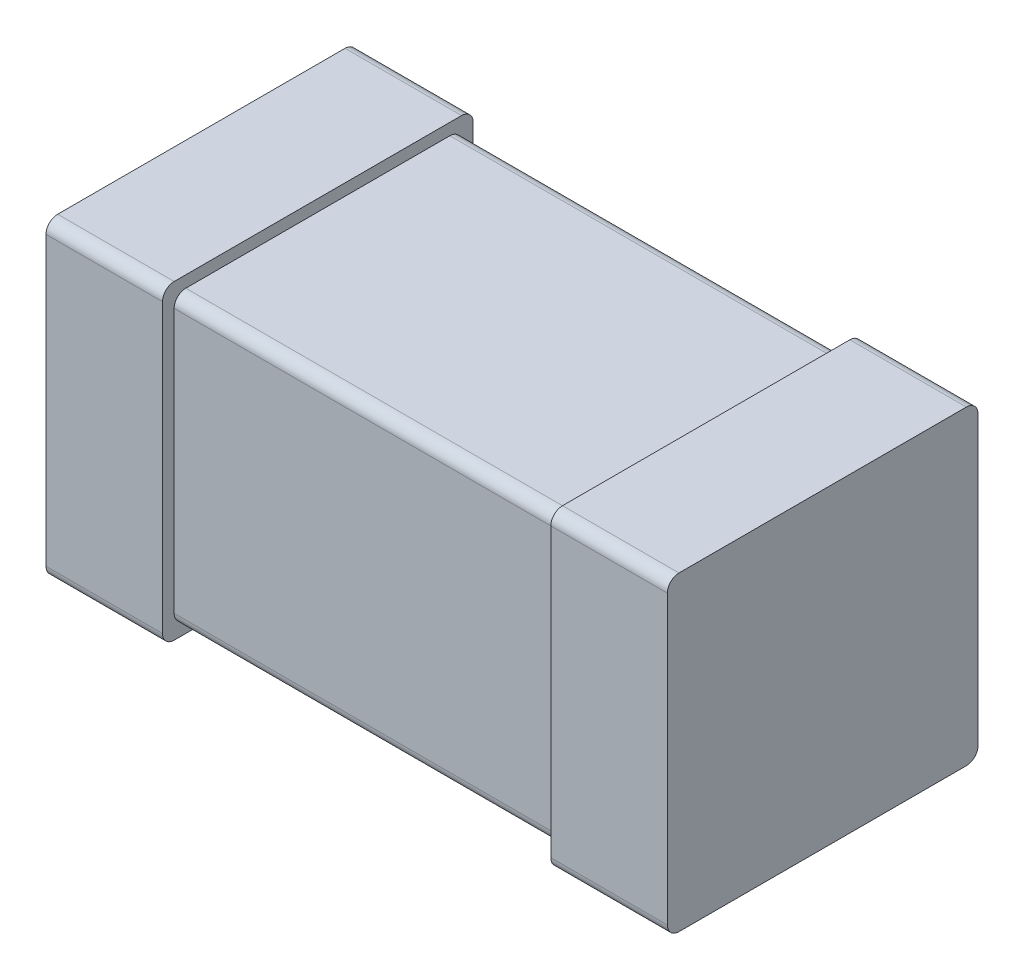
ISO-10303-21;
HEADER;
FILE_DESCRIPTION(('STEP AP214'),'2;1');
FILE_NAME('part.step','',(''),(''),'','','');
FILE_SCHEMA(('AUTOMOTIVE_DESIGN { 1 0 10303 214 1 1 1 1 }'));
ENDSEC;
DATA;
#1=APPLICATION_CONTEXT('core data for automotive mechanical design processes');
#2=APPLICATION_PROTOCOL_DEFINITION('international standard','automotive_design',2000,#1);
#3=PRODUCT_CONTEXT('',#1,'mechanical');
#4=PRODUCT('Part','Part','',(#3));
#5=PRODUCT_RELATED_PRODUCT_CATEGORY('part','',(#4));
#6=PRODUCT_DEFINITION_FORMATION('','',#4);
#7=PRODUCT_DEFINITION_CONTEXT('part definition',#1,'design');
#8=PRODUCT_DEFINITION('design','',#6,#7);
#9=PRODUCT_DEFINITION_SHAPE('','',#8);
#10=(LENGTH_UNIT() NAMED_UNIT(*) SI_UNIT(.MILLI.,.METRE.));
#11=(NAMED_UNIT(*) PLANE_ANGLE_UNIT() SI_UNIT($,.RADIAN.));
#12=(NAMED_UNIT(*) SI_UNIT($,.STERADIAN.) SOLID_ANGLE_UNIT());
#13=UNCERTAINTY_MEASURE_WITH_UNIT(LENGTH_MEASURE(1.E-05),#10,'distance_accuracy_value','');
#14=(GEOMETRIC_REPRESENTATION_CONTEXT(3) GLOBAL_UNCERTAINTY_ASSIGNED_CONTEXT((#13)) GLOBAL_UNIT_ASSIGNED_CONTEXT((#10,
#11,#12)) REPRESENTATION_CONTEXT('',''));
#15=CARTESIAN_POINT('',(0.,0.,0.));
#16=DIRECTION('',(0.,0.,1.));
#17=DIRECTION('',(1.,0.,0.));
#18=AXIS2_PLACEMENT_3D('',#15,#16,#17);
#19=CARTESIAN_POINT('',(-0.8,-0.4,0.));
#20=DIRECTION('',(1.,0.,0.));
#21=DIRECTION('',(0.,0.,-1.));
#22=AXIS2_PLACEMENT_3D('',#19,#20,#21);
#23=PLANE('',#22);
#24=CARTESIAN_POINT('',(-0.8,0.370000000000001,0.770000000000001));
#25=DIRECTION('',(1.,0.,0.));
#26=DIRECTION('',(0.,0.,-1.));
#27=AXIS2_PLACEMENT_3D('',#24,#25,#26);
#28=CIRCLE('',#27,0.0299999999999999);
#29=CARTESIAN_POINT('',(-0.8,0.4,0.770000000000001));
#30=VERTEX_POINT('',#29);
#31=CARTESIAN_POINT('',(-0.8,0.370000000000001,0.800000000000001));
#32=VERTEX_POINT('',#31);
#33=EDGE_CURVE('E298',#30,#32,#28,.T.);
#34=ORIENTED_EDGE('',*,*,#33,.F.);
#35=DIRECTION('',(0.,0.,1.));
#36=VECTOR('',#35,1.);
#37=CARTESIAN_POINT('',(-0.8,0.4,0.));
#38=LINE('',#37,#36);
#39=CARTESIAN_POINT('',(-0.8,0.4,0.0299999999999999));
#40=VERTEX_POINT('',#39);
#41=EDGE_CURVE('E225',#40,#30,#38,.T.);
#42=ORIENTED_EDGE('',*,*,#41,.F.);
#43=CARTESIAN_POINT('',(-0.8,0.370000000000001,0.0299999999999999));
#44=DIRECTION('',(1.,0.,0.));
#45=DIRECTION('',(0.,0.,-1.));
#46=AXIS2_PLACEMENT_3D('',#43,#44,#45);
#47=CIRCLE('',#46,0.0299999999999999);
#48=CARTESIAN_POINT('',(-0.8,0.370000000000001,0.));
#49=VERTEX_POINT('',#48);
#50=EDGE_CURVE('E228',#49,#40,#47,.T.);
#51=ORIENTED_EDGE('',*,*,#50,.F.);
#52=DIRECTION('',(0.,1.,0.));
#53=VECTOR('',#52,1.);
#54=CARTESIAN_POINT('',(-0.8,-0.4,0.));
#55=LINE('',#54,#53);
#56=CARTESIAN_POINT('',(-0.8,-0.370000000000001,0.));
#57=VERTEX_POINT('',#56);
#58=EDGE_CURVE('E229',#49,#57,#55,.F.);
#59=ORIENTED_EDGE('',*,*,#58,.T.);
#60=CARTESIAN_POINT('',(-0.8,-0.370000000000001,0.0299999999999999));
#61=DIRECTION('',(1.,0.,0.));
#62=DIRECTION('',(0.,0.,-1.));
#63=AXIS2_PLACEMENT_3D('',#60,#61,#62);
#64=CIRCLE('',#63,0.0299999999999999);
#65=CARTESIAN_POINT('',(-0.8,-0.4,0.0299999999999999));
#66=VERTEX_POINT('',#65);
#67=EDGE_CURVE('E192',#66,#57,#64,.T.);
#68=ORIENTED_EDGE('',*,*,#67,.F.);
#69=DIRECTION('',(0.,0.,1.));
#70=VECTOR('',#69,1.);
#71=CARTESIAN_POINT('',(-0.8,-0.4,0.));
#72=LINE('',#71,#70);
#73=CARTESIAN_POINT('',(-0.8,-0.4,0.770000000000001));
#74=VERTEX_POINT('',#73);
#75=EDGE_CURVE('E189',#66,#74,#72,.T.);
#76=ORIENTED_EDGE('',*,*,#75,.T.);
#77=CARTESIAN_POINT('',(-0.8,-0.370000000000001,0.770000000000001));
#78=DIRECTION('',(1.,0.,0.));
#79=DIRECTION('',(0.,0.,-1.));
#80=AXIS2_PLACEMENT_3D('',#77,#78,#79);
#81=CIRCLE('',#80,0.0299999999999999);
#82=CARTESIAN_POINT('',(-0.8,-0.370000000000001,0.800000000000001));
#83=VERTEX_POINT('',#82);
#84=EDGE_CURVE('E20',#83,#74,#81,.T.);
#85=ORIENTED_EDGE('',*,*,#84,.F.);
#86=DIRECTION('',(0.,1.,0.));
#87=VECTOR('',#86,1.);
#88=CARTESIAN_POINT('',(-0.8,-0.4,0.8));
#89=LINE('',#88,#87);
#90=EDGE_CURVE('E175',#32,#83,#89,.F.);
#91=ORIENTED_EDGE('',*,*,#90,.F.);
#92=EDGE_LOOP('',(#34,#42,#51,#59,#68,#76,#85,#91));
#93=FACE_BOUND('',#92,.T.);
#94=ADVANCED_FACE('F17',(#93),#23,.F.);
#95=CARTESIAN_POINT('',(0.8,-0.4,0.));
#96=DIRECTION('',(1.,0.,0.));
#97=DIRECTION('',(0.,0.,-1.));
#98=AXIS2_PLACEMENT_3D('',#95,#96,#97);
#99=PLANE('',#98);
#100=DIRECTION('',(0.,0.,1.));
#101=VECTOR('',#100,1.);
#102=CARTESIAN_POINT('',(0.8,0.4,0.));
#103=LINE('',#102,#101);
#104=CARTESIAN_POINT('',(0.8,0.4,0.770000000000001));
#105=VERTEX_POINT('',#104);
#106=CARTESIAN_POINT('',(0.8,0.4,0.0299999999999999));
#107=VERTEX_POINT('',#106);
#108=EDGE_CURVE('E211',#105,#107,#103,.F.);
#109=ORIENTED_EDGE('',*,*,#108,.F.);
#110=CARTESIAN_POINT('',(0.8,0.370000000000001,0.770000000000001));
#111=DIRECTION('',(1.,0.,0.));
#112=DIRECTION('',(0.,0.,-1.));
#113=AXIS2_PLACEMENT_3D('',#110,#111,#112);
#114=CIRCLE('',#113,0.0299999999999999);
#115=CARTESIAN_POINT('',(0.8,0.370000000000001,0.8));
#116=VERTEX_POINT('',#115);
#117=EDGE_CURVE('E286',#116,#105,#114,.F.);
#118=ORIENTED_EDGE('',*,*,#117,.F.);
#119=DIRECTION('',(0.,1.,0.));
#120=VECTOR('',#119,1.);
#121=CARTESIAN_POINT('',(0.8,-0.4,0.8));
#122=LINE('',#121,#120);
#123=CARTESIAN_POINT('',(0.8,-0.370000000000001,0.8));
#124=VERTEX_POINT('',#123);
#125=EDGE_CURVE('E206',#124,#116,#122,.T.);
#126=ORIENTED_EDGE('',*,*,#125,.F.);
#127=CARTESIAN_POINT('',(0.8,-0.370000000000001,0.770000000000001));
#128=DIRECTION('',(1.,0.,0.));
#129=DIRECTION('',(0.,0.,-1.));
#130=AXIS2_PLACEMENT_3D('',#127,#128,#129);
#131=CIRCLE('',#130,0.0299999999999999);
#132=CARTESIAN_POINT('',(0.8,-0.4,0.770000000000001));
#133=VERTEX_POINT('',#132);
#134=EDGE_CURVE('E294',#133,#124,#131,.F.);
#135=ORIENTED_EDGE('',*,*,#134,.F.);
#136=DIRECTION('',(0.,0.,1.));
#137=VECTOR('',#136,1.);
#138=CARTESIAN_POINT('',(0.8,-0.4,0.));
#139=LINE('',#138,#137);
#140=CARTESIAN_POINT('',(0.8,-0.4,0.0299999999999999));
#141=VERTEX_POINT('',#140);
#142=EDGE_CURVE('E220',#133,#141,#139,.F.);
#143=ORIENTED_EDGE('',*,*,#142,.T.);
#144=CARTESIAN_POINT('',(0.8,-0.370000000000001,0.0299999999999999));
#145=DIRECTION('',(1.,0.,0.));
#146=DIRECTION('',(0.,0.,-1.));
#147=AXIS2_PLACEMENT_3D('',#144,#145,#146);
#148=CIRCLE('',#147,0.0299999999999999);
#149=CARTESIAN_POINT('',(0.8,-0.370000000000001,0.));
#150=VERTEX_POINT('',#149);
#151=EDGE_CURVE('E222',#150,#141,#148,.F.);
#152=ORIENTED_EDGE('',*,*,#151,.F.);
#153=DIRECTION('',(0.,1.,0.));
#154=VECTOR('',#153,1.);
#155=CARTESIAN_POINT('',(0.8,-0.4,0.));
#156=LINE('',#155,#154);
#157=CARTESIAN_POINT('',(0.8,0.370000000000001,0.));
#158=VERTEX_POINT('',#157);
#159=EDGE_CURVE('E216',#150,#158,#156,.T.);
#160=ORIENTED_EDGE('',*,*,#159,.T.);
#161=CARTESIAN_POINT('',(0.8,0.370000000000001,0.0299999999999999));
#162=DIRECTION('',(1.,0.,0.));
#163=DIRECTION('',(0.,0.,-1.));
#164=AXIS2_PLACEMENT_3D('',#161,#162,#163);
#165=CIRCLE('',#164,0.0299999999999999);
#166=EDGE_CURVE('E215',#107,#158,#165,.F.);
#167=ORIENTED_EDGE('',*,*,#166,.F.);
#168=EDGE_LOOP('',(#109,#118,#126,#135,#143,#152,#160,#167));
#169=FACE_BOUND('',#168,.T.);
#170=ADVANCED_FACE('F650',(#169),#99,.T.);
#171=CARTESIAN_POINT('',(-0.8,-0.4,0.8));
#172=DIRECTION('',(0.,0.,1.));
#173=DIRECTION('',(1.,0.,0.));
#174=AXIS2_PLACEMENT_3D('',#171,#172,#173);
#175=PLANE('',#174);
#176=ORIENTED_EDGE('',*,*,#90,.T.);
#177=DIRECTION('',(1.,0.,0.));
#178=VECTOR('',#177,1.);
#179=CARTESIAN_POINT('',(-0.8,-0.370000000000001,0.800000000000001));
#180=LINE('',#179,#178);
#181=CARTESIAN_POINT('',(-0.499999999999999,-0.370000000000001,0.800000000000001));
#182=VERTEX_POINT('',#181);
#183=EDGE_CURVE('E186',#182,#83,#180,.F.);
#184=ORIENTED_EDGE('',*,*,#183,.F.);
#185=DIRECTION('',(0.,1.,0.));
#186=VECTOR('',#185,1.);
#187=CARTESIAN_POINT('',(-0.499999999999999,-0.4,0.8));
#188=LINE('',#187,#186);
#189=CARTESIAN_POINT('',(-0.499999999999999,0.370000000000001,0.800000000000001));
#190=VERTEX_POINT('',#189);
#191=EDGE_CURVE('E285',#190,#182,#188,.F.);
#192=ORIENTED_EDGE('',*,*,#191,.F.);
#193=DIRECTION('',(1.,0.,0.));
#194=VECTOR('',#193,1.);
#195=CARTESIAN_POINT('',(-0.8,0.370000000000001,0.800000000000001));
#196=LINE('',#195,#194);
#197=EDGE_CURVE('E297',#32,#190,#196,.T.);
#198=ORIENTED_EDGE('',*,*,#197,.F.);
#199=EDGE_LOOP('',(#176,#184,#192,#198));
#200=FACE_BOUND('',#199,.T.);
#201=ADVANCED_FACE('F642',(#200),#175,.T.);
#202=CARTESIAN_POINT('',(-0.8,-0.370000000000001,0.770000000000001));
#203=DIRECTION('',(1.,0.,0.));
#204=DIRECTION('',(0.,0.,-1.));
#205=AXIS2_PLACEMENT_3D('',#202,#203,#204);
#206=CYLINDRICAL_SURFACE('',#205,0.0299999999999999);
#207=DIRECTION('',(1.,0.,0.));
#208=VECTOR('',#207,1.);
#209=CARTESIAN_POINT('',(-0.8,-0.4,0.770000000000001));
#210=LINE('',#209,#208);
#211=CARTESIAN_POINT('',(-0.499999999999999,-0.4,0.770000000000001));
#212=VERTEX_POINT('',#211);
#213=EDGE_CURVE('E184',#74,#212,#210,.T.);
#214=ORIENTED_EDGE('',*,*,#213,.T.);
#215=CARTESIAN_POINT('',(-0.499999999999999,-0.370000000000001,0.770000000000001));
#216=DIRECTION('',(1.,0.,0.));
#217=DIRECTION('',(0.,0.,-1.));
#218=AXIS2_PLACEMENT_3D('',#215,#216,#217);
#219=CIRCLE('',#218,0.0299999999999999);
#220=EDGE_CURVE('E283',#182,#212,#219,.T.);
#221=ORIENTED_EDGE('',*,*,#220,.F.);
#222=ORIENTED_EDGE('',*,*,#183,.T.);
#223=ORIENTED_EDGE('',*,*,#84,.T.);
#224=EDGE_LOOP('',(#214,#221,#222,#223));
#225=FACE_BOUND('',#224,.T.);
#226=ADVANCED_FACE('F181',(#225),#206,.T.);
#227=CARTESIAN_POINT('',(-0.8,-0.4,0.));
#228=DIRECTION('',(0.,1.,0.));
#229=DIRECTION('',(0.,0.,1.));
#230=AXIS2_PLACEMENT_3D('',#227,#228,#229);
#231=PLANE('',#230);
#232=DIRECTION('',(1.,0.,0.));
#233=VECTOR('',#232,1.);
#234=CARTESIAN_POINT('',(-0.8,-0.400000000000001,0.0299999999999999));
#235=LINE('',#234,#233);
#236=CARTESIAN_POINT('',(-0.499999999999999,-0.4,0.0299999999999999));
#237=VERTEX_POINT('',#236);
#238=EDGE_CURVE('E195',#237,#66,#235,.F.);
#239=ORIENTED_EDGE('',*,*,#238,.F.);
#240=DIRECTION('',(0.,0.,-1.));
#241=VECTOR('',#240,1.);
#242=CARTESIAN_POINT('',(-0.499999999999999,-0.4,0.));
#243=LINE('',#242,#241);
#244=EDGE_CURVE('E199',#212,#237,#243,.T.);
#245=ORIENTED_EDGE('',*,*,#244,.F.);
#246=ORIENTED_EDGE('',*,*,#213,.F.);
#247=ORIENTED_EDGE('',*,*,#75,.F.);
#248=EDGE_LOOP('',(#239,#245,#246,#247));
#249=FACE_BOUND('',#248,.T.);
#250=ADVANCED_FACE('F197',(#249),#231,.F.);
#251=CARTESIAN_POINT('',(-0.8,-0.370000000000001,0.0299999999999999));
#252=DIRECTION('',(1.,0.,0.));
#253=DIRECTION('',(0.,0.,-1.));
#254=AXIS2_PLACEMENT_3D('',#251,#252,#253);
#255=CYLINDRICAL_SURFACE('',#254,0.0299999999999999);
#256=ORIENTED_EDGE('',*,*,#67,.T.);
#257=DIRECTION('',(1.,0.,0.));
#258=VECTOR('',#257,1.);
#259=CARTESIAN_POINT('',(-0.8,-0.370000000000001,0.));
#260=LINE('',#259,#258);
#261=CARTESIAN_POINT('',(-0.499999999999999,-0.370000000000001,0.));
#262=VERTEX_POINT('',#261);
#263=EDGE_CURVE('E230',#57,#262,#260,.T.);
#264=ORIENTED_EDGE('',*,*,#263,.T.);
#265=CARTESIAN_POINT('',(-0.499999999999999,-0.370000000000001,0.0299999999999999));
#266=DIRECTION('',(1.,0.,0.));
#267=DIRECTION('',(0.,0.,-1.));
#268=AXIS2_PLACEMENT_3D('',#265,#266,#267);
#269=CIRCLE('',#268,0.0299999999999999);
#270=EDGE_CURVE('E280',#237,#262,#269,.T.);
#271=ORIENTED_EDGE('',*,*,#270,.F.);
#272=ORIENTED_EDGE('',*,*,#238,.T.);
#273=EDGE_LOOP('',(#256,#264,#271,#272));
#274=FACE_BOUND('',#273,.T.);
#275=ADVANCED_FACE('F307',(#274),#255,.T.);
#276=CARTESIAN_POINT('',(-0.8,-0.4,0.));
#277=DIRECTION('',(0.,0.,1.));
#278=DIRECTION('',(1.,0.,0.));
#279=AXIS2_PLACEMENT_3D('',#276,#277,#278);
#280=PLANE('',#279);
#281=ORIENTED_EDGE('',*,*,#263,.F.);
#282=ORIENTED_EDGE('',*,*,#58,.F.);
#283=DIRECTION('',(1.,0.,0.));
#284=VECTOR('',#283,1.);
#285=CARTESIAN_POINT('',(-0.8,0.370000000000001,0.));
#286=LINE('',#285,#284);
#287=CARTESIAN_POINT('',(-0.499999999999999,0.370000000000001,0.));
#288=VERTEX_POINT('',#287);
#289=EDGE_CURVE('E303',#288,#49,#286,.F.);
#290=ORIENTED_EDGE('',*,*,#289,.F.);
#291=DIRECTION('',(0.,1.,0.));
#292=VECTOR('',#291,1.);
#293=CARTESIAN_POINT('',(-0.499999999999999,-0.4,0.));
#294=LINE('',#293,#292);
#295=EDGE_CURVE('E279',#262,#288,#294,.T.);
#296=ORIENTED_EDGE('',*,*,#295,.F.);
#297=EDGE_LOOP('',(#281,#282,#290,#296));
#298=FACE_BOUND('',#297,.T.);
#299=ADVANCED_FACE('F362',(#298),#280,.F.);
#300=CARTESIAN_POINT('',(-0.8,0.370000000000001,0.0299999999999999));
#301=DIRECTION('',(1.,0.,0.));
#302=DIRECTION('',(0.,0.,-1.));
#303=AXIS2_PLACEMENT_3D('',#300,#301,#302);
#304=CYLINDRICAL_SURFACE('',#303,0.0299999999999999);
#305=DIRECTION('',(1.,0.,0.));
#306=VECTOR('',#305,1.);
#307=CARTESIAN_POINT('',(-0.8,0.4,0.0299999999999999));
#308=LINE('',#307,#306);
#309=CARTESIAN_POINT('',(-0.499999999999999,0.4,0.0299999999999999));
#310=VERTEX_POINT('',#309);
#311=EDGE_CURVE('E227',#310,#40,#308,.F.);
#312=ORIENTED_EDGE('',*,*,#311,.F.);
#313=CARTESIAN_POINT('',(-0.499999999999999,0.370000000000001,0.0299999999999999));
#314=DIRECTION('',(1.,0.,0.));
#315=DIRECTION('',(0.,0.,-1.));
#316=AXIS2_PLACEMENT_3D('',#313,#314,#315);
#317=CIRCLE('',#316,0.0299999999999999);
#318=EDGE_CURVE('E276',#288,#310,#317,.T.);
#319=ORIENTED_EDGE('',*,*,#318,.F.);
#320=ORIENTED_EDGE('',*,*,#289,.T.);
#321=ORIENTED_EDGE('',*,*,#50,.T.);
#322=EDGE_LOOP('',(#312,#319,#320,#321));
#323=FACE_BOUND('',#322,.T.);
#324=ADVANCED_FACE('F359',(#323),#304,.T.);
#325=CARTESIAN_POINT('',(-0.8,0.4,0.));
#326=DIRECTION('',(0.,1.,0.));
#327=DIRECTION('',(0.,0.,1.));
#328=AXIS2_PLACEMENT_3D('',#325,#326,#327);
#329=PLANE('',#328);
#330=DIRECTION('',(0.,0.,-1.));
#331=VECTOR('',#330,1.);
#332=CARTESIAN_POINT('',(-0.499999999999999,0.4,0.));
#333=LINE('',#332,#331);
#334=CARTESIAN_POINT('',(-0.499999999999999,0.4,0.770000000000001));
#335=VERTEX_POINT('',#334);
#336=EDGE_CURVE('E275',#310,#335,#333,.F.);
#337=ORIENTED_EDGE('',*,*,#336,.F.);
#338=ORIENTED_EDGE('',*,*,#311,.T.);
#339=ORIENTED_EDGE('',*,*,#41,.T.);
#340=DIRECTION('',(1.,0.,0.));
#341=VECTOR('',#340,1.);
#342=CARTESIAN_POINT('',(-0.8,0.400000000000001,0.770000000000001));
#343=LINE('',#342,#341);
#344=EDGE_CURVE('E301',#335,#30,#343,.F.);
#345=ORIENTED_EDGE('',*,*,#344,.F.);
#346=EDGE_LOOP('',(#337,#338,#339,#345));
#347=FACE_BOUND('',#346,.T.);
#348=ADVANCED_FACE('F365',(#347),#329,.T.);
#349=CARTESIAN_POINT('',(-0.8,0.370000000000001,0.770000000000001));
#350=DIRECTION('',(1.,0.,0.));
#351=DIRECTION('',(0.,0.,-1.));
#352=AXIS2_PLACEMENT_3D('',#349,#350,#351);
#353=CYLINDRICAL_SURFACE('',#352,0.0299999999999999);
#354=ORIENTED_EDGE('',*,*,#33,.T.);
#355=ORIENTED_EDGE('',*,*,#197,.T.);
#356=CARTESIAN_POINT('',(-0.499999999999999,0.370000000000001,0.770000000000001));
#357=DIRECTION('',(1.,0.,0.));
#358=DIRECTION('',(0.,0.,-1.));
#359=AXIS2_PLACEMENT_3D('',#356,#357,#358);
#360=CIRCLE('',#359,0.0299999999999999);
#361=EDGE_CURVE('E272',#335,#190,#360,.T.);
#362=ORIENTED_EDGE('',*,*,#361,.F.);
#363=ORIENTED_EDGE('',*,*,#344,.T.);
#364=EDGE_LOOP('',(#354,#355,#362,#363));
#365=FACE_BOUND('',#364,.T.);
#366=ADVANCED_FACE('F590',(#365),#353,.T.);
#367=CARTESIAN_POINT('',(0.499999999999999,-0.370000000000001,0.770000000000001));
#368=DIRECTION('',(1.,0.,0.));
#369=DIRECTION('',(0.,0.,-1.));
#370=AXIS2_PLACEMENT_3D('',#367,#368,#369);
#371=CYLINDRICAL_SURFACE('',#370,0.0299999999999999);
#372=DIRECTION('',(1.,0.,0.));
#373=VECTOR('',#372,1.);
#374=CARTESIAN_POINT('',(0.499999999999999,-0.4,0.770000000000001));
#375=LINE('',#374,#373);
#376=CARTESIAN_POINT('',(0.499999999999999,-0.4,0.770000000000001));
#377=VERTEX_POINT('',#376);
#378=EDGE_CURVE('E223',#377,#133,#375,.T.);
#379=ORIENTED_EDGE('',*,*,#378,.T.);
#380=ORIENTED_EDGE('',*,*,#134,.T.);
#381=DIRECTION('',(1.,0.,0.));
#382=VECTOR('',#381,1.);
#383=CARTESIAN_POINT('',(0.499999999999999,-0.370000000000001,0.8));
#384=LINE('',#383,#382);
#385=CARTESIAN_POINT('',(0.499999999999999,-0.370000000000001,0.8));
#386=VERTEX_POINT('',#385);
#387=EDGE_CURVE('E332',#386,#124,#384,.T.);
#388=ORIENTED_EDGE('',*,*,#387,.F.);
#389=CARTESIAN_POINT('',(0.499999999999999,-0.370000000000001,0.770000000000001));
#390=DIRECTION('',(1.,0.,0.));
#391=DIRECTION('',(0.,0.,-1.));
#392=AXIS2_PLACEMENT_3D('',#389,#390,#391);
#393=CIRCLE('',#392,0.0299999999999999);
#394=EDGE_CURVE('E257',#386,#377,#393,.T.);
#395=ORIENTED_EDGE('',*,*,#394,.T.);
#396=EDGE_LOOP('',(#379,#380,#388,#395));
#397=FACE_BOUND('',#396,.T.);
#398=ADVANCED_FACE('F581',(#397),#371,.T.);
#399=CARTESIAN_POINT('',(0.499999999999999,-0.4,0.));
#400=DIRECTION('',(0.,1.,0.));
#401=DIRECTION('',(0.,0.,1.));
#402=AXIS2_PLACEMENT_3D('',#399,#400,#401);
#403=PLANE('',#402);
#404=DIRECTION('',(1.,0.,0.));
#405=VECTOR('',#404,1.);
#406=CARTESIAN_POINT('',(0.499999999999999,-0.400000000000001,0.0299999999999999));
#407=LINE('',#406,#405);
#408=CARTESIAN_POINT('',(0.499999999999999,-0.4,0.0299999999999999));
#409=VERTEX_POINT('',#408);
#410=EDGE_CURVE('E293',#141,#409,#407,.F.);
#411=ORIENTED_EDGE('',*,*,#410,.F.);
#412=ORIENTED_EDGE('',*,*,#142,.F.);
#413=ORIENTED_EDGE('',*,*,#378,.F.);
#414=DIRECTION('',(0.,0.,-1.));
#415=VECTOR('',#414,1.);
#416=CARTESIAN_POINT('',(0.499999999999999,-0.4,0.));
#417=LINE('',#416,#415);
#418=EDGE_CURVE('E256',#377,#409,#417,.T.);
#419=ORIENTED_EDGE('',*,*,#418,.T.);
#420=EDGE_LOOP('',(#411,#412,#413,#419));
#421=FACE_BOUND('',#420,.T.);
#422=ADVANCED_FACE('F572',(#421),#403,.F.);
#423=CARTESIAN_POINT('',(0.499999999999999,-0.370000000000001,0.0299999999999999));
#424=DIRECTION('',(1.,0.,0.));
#425=DIRECTION('',(0.,0.,-1.));
#426=AXIS2_PLACEMENT_3D('',#423,#424,#425);
#427=CYLINDRICAL_SURFACE('',#426,0.0299999999999999);
#428=CARTESIAN_POINT('',(0.499999999999999,-0.370000000000001,0.0299999999999999));
#429=DIRECTION('',(1.,0.,0.));
#430=DIRECTION('',(0.,0.,-1.));
#431=AXIS2_PLACEMENT_3D('',#428,#429,#430);
#432=CIRCLE('',#431,0.0299999999999999);
#433=CARTESIAN_POINT('',(0.499999999999999,-0.370000000000001,0.));
#434=VERTEX_POINT('',#433);
#435=EDGE_CURVE('E254',#409,#434,#432,.T.);
#436=ORIENTED_EDGE('',*,*,#435,.T.);
#437=DIRECTION('',(1.,0.,0.));
#438=VECTOR('',#437,1.);
#439=CARTESIAN_POINT('',(0.499999999999999,-0.370000000000001,0.));
#440=LINE('',#439,#438);
#441=EDGE_CURVE('E219',#434,#150,#440,.T.);
#442=ORIENTED_EDGE('',*,*,#441,.T.);
#443=ORIENTED_EDGE('',*,*,#151,.T.);
#444=ORIENTED_EDGE('',*,*,#410,.T.);
#445=EDGE_LOOP('',(#436,#442,#443,#444));
#446=FACE_BOUND('',#445,.T.);
#447=ADVANCED_FACE('F563',(#446),#427,.T.);
#448=CARTESIAN_POINT('',(0.499999999999999,-0.4,0.));
#449=DIRECTION('',(0.,0.,1.));
#450=DIRECTION('',(1.,0.,0.));
#451=AXIS2_PLACEMENT_3D('',#448,#449,#450);
#452=PLANE('',#451);
#453=ORIENTED_EDGE('',*,*,#441,.F.);
#454=DIRECTION('',(0.,1.,0.));
#455=VECTOR('',#454,1.);
#456=CARTESIAN_POINT('',(0.499999999999999,-0.4,0.));
#457=LINE('',#456,#455);
#458=CARTESIAN_POINT('',(0.499999999999999,0.370000000000001,0.));
#459=VERTEX_POINT('',#458);
#460=EDGE_CURVE('E253',#434,#459,#457,.T.);
#461=ORIENTED_EDGE('',*,*,#460,.T.);
#462=DIRECTION('',(1.,0.,0.));
#463=VECTOR('',#462,1.);
#464=CARTESIAN_POINT('',(0.499999999999999,0.370000000000001,0.));
#465=LINE('',#464,#463);
#466=EDGE_CURVE('E218',#158,#459,#465,.F.);
#467=ORIENTED_EDGE('',*,*,#466,.F.);
#468=ORIENTED_EDGE('',*,*,#159,.F.);
#469=EDGE_LOOP('',(#453,#461,#467,#468));
#470=FACE_BOUND('',#469,.T.);
#471=ADVANCED_FACE('F554',(#470),#452,.F.);
#472=CARTESIAN_POINT('',(0.499999999999999,0.370000000000001,0.0299999999999999));
#473=DIRECTION('',(1.,0.,0.));
#474=DIRECTION('',(0.,0.,-1.));
#475=AXIS2_PLACEMENT_3D('',#472,#473,#474);
#476=CYLINDRICAL_SURFACE('',#475,0.0299999999999999);
#477=DIRECTION('',(1.,0.,0.));
#478=VECTOR('',#477,1.);
#479=CARTESIAN_POINT('',(0.499999999999999,0.4,0.0299999999999999));
#480=LINE('',#479,#478);
#481=CARTESIAN_POINT('',(0.499999999999999,0.4,0.0299999999999999));
#482=VERTEX_POINT('',#481);
#483=EDGE_CURVE('E214',#107,#482,#480,.F.);
#484=ORIENTED_EDGE('',*,*,#483,.F.);
#485=ORIENTED_EDGE('',*,*,#166,.T.);
#486=ORIENTED_EDGE('',*,*,#466,.T.);
#487=CARTESIAN_POINT('',(0.499999999999999,0.370000000000001,0.0299999999999999));
#488=DIRECTION('',(1.,0.,0.));
#489=DIRECTION('',(0.,0.,-1.));
#490=AXIS2_PLACEMENT_3D('',#487,#488,#489);
#491=CIRCLE('',#490,0.0299999999999999);
#492=EDGE_CURVE('E251',#459,#482,#491,.T.);
#493=ORIENTED_EDGE('',*,*,#492,.T.);
#494=EDGE_LOOP('',(#484,#485,#486,#493));
#495=FACE_BOUND('',#494,.T.);
#496=ADVANCED_FACE('F545',(#495),#476,.T.);
#497=CARTESIAN_POINT('',(0.499999999999999,0.4,0.));
#498=DIRECTION('',(0.,1.,0.));
#499=DIRECTION('',(0.,0.,1.));
#500=AXIS2_PLACEMENT_3D('',#497,#498,#499);
#501=PLANE('',#500);
#502=ORIENTED_EDGE('',*,*,#108,.T.);
#503=ORIENTED_EDGE('',*,*,#483,.T.);
#504=DIRECTION('',(0.,0.,-1.));
#505=VECTOR('',#504,1.);
#506=CARTESIAN_POINT('',(0.499999999999999,0.4,0.));
#507=LINE('',#506,#505);
#508=CARTESIAN_POINT('',(0.499999999999999,0.4,0.770000000000001));
#509=VERTEX_POINT('',#508);
#510=EDGE_CURVE('E250',#482,#509,#507,.F.);
#511=ORIENTED_EDGE('',*,*,#510,.T.);
#512=DIRECTION('',(1.,0.,0.));
#513=VECTOR('',#512,1.);
#514=CARTESIAN_POINT('',(0.499999999999999,0.400000000000001,0.770000000000001));
#515=LINE('',#514,#513);
#516=EDGE_CURVE('E210',#105,#509,#515,.F.);
#517=ORIENTED_EDGE('',*,*,#516,.F.);
#518=EDGE_LOOP('',(#502,#503,#511,#517));
#519=FACE_BOUND('',#518,.T.);
#520=ADVANCED_FACE('F536',(#519),#501,.T.);
#521=CARTESIAN_POINT('',(0.499999999999999,0.370000000000001,0.770000000000001));
#522=DIRECTION('',(1.,0.,0.));
#523=DIRECTION('',(0.,0.,-1.));
#524=AXIS2_PLACEMENT_3D('',#521,#522,#523);
#525=CYLINDRICAL_SURFACE('',#524,0.0299999999999999);
#526=CARTESIAN_POINT('',(0.499999999999999,0.370000000000001,0.770000000000001));
#527=DIRECTION('',(1.,0.,0.));
#528=DIRECTION('',(0.,0.,-1.));
#529=AXIS2_PLACEMENT_3D('',#526,#527,#528);
#530=CIRCLE('',#529,0.0299999999999999);
#531=CARTESIAN_POINT('',(0.499999999999999,0.370000000000001,0.8));
#532=VERTEX_POINT('',#531);
#533=EDGE_CURVE('E247',#509,#532,#530,.T.);
#534=ORIENTED_EDGE('',*,*,#533,.T.);
#535=DIRECTION('',(1.,0.,0.));
#536=VECTOR('',#535,1.);
#537=CARTESIAN_POINT('',(0.499999999999999,0.370000000000001,0.8));
#538=LINE('',#537,#536);
#539=EDGE_CURVE('E209',#116,#532,#538,.F.);
#540=ORIENTED_EDGE('',*,*,#539,.F.);
#541=ORIENTED_EDGE('',*,*,#117,.T.);
#542=ORIENTED_EDGE('',*,*,#516,.T.);
#543=EDGE_LOOP('',(#534,#540,#541,#542));
#544=FACE_BOUND('',#543,.T.);
#545=ADVANCED_FACE('F527',(#544),#525,.T.);
#546=CARTESIAN_POINT('',(0.499999999999999,-0.4,0.8));
#547=DIRECTION('',(0.,0.,1.));
#548=DIRECTION('',(1.,0.,0.));
#549=AXIS2_PLACEMENT_3D('',#546,#547,#548);
#550=PLANE('',#549);
#551=DIRECTION('',(0.,1.,0.));
#552=VECTOR('',#551,1.);
#553=CARTESIAN_POINT('',(0.499999999999999,-0.4,0.8));
#554=LINE('',#553,#552);
#555=EDGE_CURVE('E249',#532,#386,#554,.F.);
#556=ORIENTED_EDGE('',*,*,#555,.T.);
#557=ORIENTED_EDGE('',*,*,#387,.T.);
#558=ORIENTED_EDGE('',*,*,#125,.T.);
#559=ORIENTED_EDGE('',*,*,#539,.T.);
#560=EDGE_LOOP('',(#556,#557,#558,#559));
#561=FACE_BOUND('',#560,.T.);
#562=ADVANCED_FACE('F518',(#561),#550,.T.);
#563=CARTESIAN_POINT('',(-0.499999999999999,-0.339999999999999,0.06));
#564=DIRECTION('',(1.,0.,0.));
#565=DIRECTION('',(0.,0.,-1.));
#566=AXIS2_PLACEMENT_3D('',#563,#564,#565);
#567=CYLINDRICAL_SURFACE('',#566,0.0299999999999999);
#568=CARTESIAN_POINT('',(-0.499999999999999,-0.339999999999999,0.06));
#569=DIRECTION('',(1.,0.,0.));
#570=DIRECTION('',(0.,0.,-1.));
#571=AXIS2_PLACEMENT_3D('',#568,#569,#570);
#572=CIRCLE('',#571,0.0299999999999999);
#573=CARTESIAN_POINT('',(-0.499999999999999,-0.339999999999999,0.0299999999999999));
#574=VERTEX_POINT('',#573);
#575=CARTESIAN_POINT('',(-0.499999999999999,-0.370000000000001,0.06));
#576=VERTEX_POINT('',#575);
#577=EDGE_CURVE('E268',#574,#576,#572,.F.);
#578=ORIENTED_EDGE('',*,*,#577,.F.);
#579=DIRECTION('',(1.,0.,0.));
#580=VECTOR('',#579,1.);
#581=CARTESIAN_POINT('',(-0.499999999999999,-0.339999999999999,0.0299999999999999));
#582=LINE('',#581,#580);
#583=CARTESIAN_POINT('',(0.499999999999999,-0.339999999999999,0.0299999999999999));
#584=VERTEX_POINT('',#583);
#585=EDGE_CURVE('E319',#574,#584,#582,.T.);
#586=ORIENTED_EDGE('',*,*,#585,.T.);
#587=CARTESIAN_POINT('',(0.499999999999999,-0.339999999999999,0.06));
#588=DIRECTION('',(1.,0.,0.));
#589=DIRECTION('',(0.,0.,-1.));
#590=AXIS2_PLACEMENT_3D('',#587,#588,#589);
#591=CIRCLE('',#590,0.0299999999999999);
#592=CARTESIAN_POINT('',(0.499999999999999,-0.370000000000001,0.06));
#593=VERTEX_POINT('',#592);
#594=EDGE_CURVE('E244',#584,#593,#591,.F.);
#595=ORIENTED_EDGE('',*,*,#594,.T.);
#596=DIRECTION('',(1.,0.,0.));
#597=VECTOR('',#596,1.);
#598=CARTESIAN_POINT('',(-0.499999999999999,-0.370000000000001,0.06));
#599=LINE('',#598,#597);
#600=EDGE_CURVE('E330',#593,#576,#599,.F.);
#601=ORIENTED_EDGE('',*,*,#600,.T.);
#602=EDGE_LOOP('',(#578,#586,#595,#601));
#603=FACE_BOUND('',#602,.T.);
#604=ADVANCED_FACE('F413',(#603),#567,.T.);
#605=CARTESIAN_POINT('',(-0.499999999999999,-0.370000000000001,0.0299999999999999));
#606=DIRECTION('',(0.,1.,0.));
#607=DIRECTION('',(0.,0.,1.));
#608=AXIS2_PLACEMENT_3D('',#605,#606,#607);
#609=PLANE('',#608);
#610=ORIENTED_EDGE('',*,*,#600,.F.);
#611=DIRECTION('',(0.,0.,-1.));
#612=VECTOR('',#611,1.);
#613=CARTESIAN_POINT('',(0.499999999999999,-0.370000000000001,0.));
#614=LINE('',#613,#612);
#615=CARTESIAN_POINT('',(0.499999999999999,-0.37,0.739999999999999));
#616=VERTEX_POINT('',#615);
#617=EDGE_CURVE('E243',#593,#616,#614,.F.);
#618=ORIENTED_EDGE('',*,*,#617,.T.);
#619=DIRECTION('',(1.,0.,0.));
#620=VECTOR('',#619,1.);
#621=CARTESIAN_POINT('',(-0.499999999999999,-0.369999999999999,0.739999999999999));
#622=LINE('',#621,#620);
#623=CARTESIAN_POINT('',(-0.499999999999999,-0.37,0.739999999999999));
#624=VERTEX_POINT('',#623);
#625=EDGE_CURVE('E327',#624,#616,#622,.T.);
#626=ORIENTED_EDGE('',*,*,#625,.F.);
#627=DIRECTION('',(0.,0.,-1.));
#628=VECTOR('',#627,1.);
#629=CARTESIAN_POINT('',(-0.499999999999999,-0.370000000000001,0.));
#630=LINE('',#629,#628);
#631=EDGE_CURVE('E267',#576,#624,#630,.F.);
#632=ORIENTED_EDGE('',*,*,#631,.F.);
#633=EDGE_LOOP('',(#610,#618,#626,#632));
#634=FACE_BOUND('',#633,.T.);
#635=ADVANCED_FACE('F416',(#634),#609,.F.);
#636=CARTESIAN_POINT('',(-0.499999999999999,-0.339999999999999,0.739999999999999));
#637=DIRECTION('',(1.,0.,0.));
#638=DIRECTION('',(0.,0.,-1.));
#639=AXIS2_PLACEMENT_3D('',#636,#637,#638);
#640=CYLINDRICAL_SURFACE('',#639,0.0299999999999999);
#641=ORIENTED_EDGE('',*,*,#625,.T.);
#642=CARTESIAN_POINT('',(0.499999999999999,-0.339999999999999,0.739999999999999));
#643=DIRECTION('',(1.,0.,0.));
#644=DIRECTION('',(0.,0.,-1.));
#645=AXIS2_PLACEMENT_3D('',#642,#643,#644);
#646=CIRCLE('',#645,0.0299999999999999);
#647=CARTESIAN_POINT('',(0.499999999999999,-0.339999999999999,0.770000000000001));
#648=VERTEX_POINT('',#647);
#649=EDGE_CURVE('E241',#616,#648,#646,.F.);
#650=ORIENTED_EDGE('',*,*,#649,.T.);
#651=DIRECTION('',(1.,0.,0.));
#652=VECTOR('',#651,1.);
#653=CARTESIAN_POINT('',(-0.499999999999999,-0.339999999999999,0.770000000000001));
#654=LINE('',#653,#652);
#655=CARTESIAN_POINT('',(-0.499999999999999,-0.339999999999999,0.770000000000001));
#656=VERTEX_POINT('',#655);
#657=EDGE_CURVE('E324',#656,#648,#654,.T.);
#658=ORIENTED_EDGE('',*,*,#657,.F.);
#659=CARTESIAN_POINT('',(-0.499999999999999,-0.339999999999999,0.739999999999999));
#660=DIRECTION('',(1.,0.,0.));
#661=DIRECTION('',(0.,0.,-1.));
#662=AXIS2_PLACEMENT_3D('',#659,#660,#661);
#663=CIRCLE('',#662,0.0299999999999999);
#664=EDGE_CURVE('E264',#624,#656,#663,.F.);
#665=ORIENTED_EDGE('',*,*,#664,.F.);
#666=EDGE_LOOP('',(#641,#650,#658,#665));
#667=FACE_BOUND('',#666,.T.);
#668=ADVANCED_FACE('F419',(#667),#640,.T.);
#669=CARTESIAN_POINT('',(-0.499999999999999,-0.370000000000001,0.770000000000001));
#670=DIRECTION('',(0.,0.,1.));
#671=DIRECTION('',(1.,0.,0.));
#672=AXIS2_PLACEMENT_3D('',#669,#670,#671);
#673=PLANE('',#672);
#674=DIRECTION('',(0.,1.,0.));
#675=VECTOR('',#674,1.);
#676=CARTESIAN_POINT('',(-0.499999999999999,-0.4,0.770000000000001));
#677=LINE('',#676,#675);
#678=CARTESIAN_POINT('',(-0.499999999999999,0.339999999999999,0.77));
#679=VERTEX_POINT('',#678);
#680=EDGE_CURVE('E263',#656,#679,#677,.T.);
#681=ORIENTED_EDGE('',*,*,#680,.F.);
#682=ORIENTED_EDGE('',*,*,#657,.T.);
#683=DIRECTION('',(0.,1.,0.));
#684=VECTOR('',#683,1.);
#685=CARTESIAN_POINT('',(0.499999999999999,-0.4,0.770000000000001));
#686=LINE('',#685,#684);
#687=CARTESIAN_POINT('',(0.499999999999999,0.339999999999999,0.77));
#688=VERTEX_POINT('',#687);
#689=EDGE_CURVE('E240',#648,#688,#686,.T.);
#690=ORIENTED_EDGE('',*,*,#689,.T.);
#691=DIRECTION('',(1.,0.,0.));
#692=VECTOR('',#691,1.);
#693=CARTESIAN_POINT('',(-0.499999999999999,0.339999999999999,0.769999999999999));
#694=LINE('',#693,#692);
#695=EDGE_CURVE('E259',#679,#688,#694,.T.);
#696=ORIENTED_EDGE('',*,*,#695,.F.);
#697=EDGE_LOOP('',(#681,#682,#690,#696));
#698=FACE_BOUND('',#697,.T.);
#699=ADVANCED_FACE('F392',(#698),#673,.T.);
#700=CARTESIAN_POINT('',(-0.499999999999999,-0.370000000000001,0.0299999999999999));
#701=DIRECTION('',(0.,0.,1.));
#702=DIRECTION('',(1.,0.,0.));
#703=AXIS2_PLACEMENT_3D('',#700,#701,#702);
#704=PLANE('',#703);
#705=ORIENTED_EDGE('',*,*,#585,.F.);
#706=DIRECTION('',(0.,1.,0.));
#707=VECTOR('',#706,1.);
#708=CARTESIAN_POINT('',(-0.499999999999999,-0.4,0.0299999999999999));
#709=LINE('',#708,#707);
#710=CARTESIAN_POINT('',(-0.499999999999999,0.339999999999999,0.03));
#711=VERTEX_POINT('',#710);
#712=EDGE_CURVE('E271',#711,#574,#709,.F.);
#713=ORIENTED_EDGE('',*,*,#712,.F.);
#714=DIRECTION('',(1.,0.,0.));
#715=VECTOR('',#714,1.);
#716=CARTESIAN_POINT('',(-0.499999999999999,0.339999999999999,0.0300000000000001));
#717=LINE('',#716,#715);
#718=CARTESIAN_POINT('',(0.499999999999999,0.339999999999999,0.03));
#719=VERTEX_POINT('',#718);
#720=EDGE_CURVE('E237',#719,#711,#717,.F.);
#721=ORIENTED_EDGE('',*,*,#720,.F.);
#722=DIRECTION('',(0.,1.,0.));
#723=VECTOR('',#722,1.);
#724=CARTESIAN_POINT('',(0.499999999999999,-0.4,0.0299999999999999));
#725=LINE('',#724,#723);
#726=EDGE_CURVE('E246',#719,#584,#725,.F.);
#727=ORIENTED_EDGE('',*,*,#726,.T.);
#728=EDGE_LOOP('',(#705,#713,#721,#727));
#729=FACE_BOUND('',#728,.T.);
#730=ADVANCED_FACE('F407',(#729),#704,.F.);
#731=CARTESIAN_POINT('',(-0.499999999999999,-0.4,0.));
#732=DIRECTION('',(1.,0.,0.));
#733=DIRECTION('',(0.,0.,-1.));
#734=AXIS2_PLACEMENT_3D('',#731,#732,#733);
#735=PLANE('',#734);
#736=CARTESIAN_POINT('',(-0.499999999999999,0.339999999999999,0.739999999999999));
#737=DIRECTION('',(1.,0.,0.));
#738=DIRECTION('',(0.,0.,-1.));
#739=AXIS2_PLACEMENT_3D('',#736,#737,#738);
#740=CIRCLE('',#739,0.0299999999999999);
#741=CARTESIAN_POINT('',(-0.499999999999999,0.370000000000001,0.739999999999999));
#742=VERTEX_POINT('',#741);
#743=EDGE_CURVE('E260',#742,#679,#740,.T.);
#744=ORIENTED_EDGE('',*,*,#743,.F.);
#745=DIRECTION('',(0.,0.,1.));
#746=VECTOR('',#745,1.);
#747=CARTESIAN_POINT('',(-0.499999999999999,0.370000000000001,0.0299999999999999));
#748=LINE('',#747,#746);
#749=CARTESIAN_POINT('',(-0.499999999999999,0.370000000000001,0.06));
#750=VERTEX_POINT('',#749);
#751=EDGE_CURVE('E233',#750,#742,#748,.T.);
#752=ORIENTED_EDGE('',*,*,#751,.F.);
#753=CARTESIAN_POINT('',(-0.499999999999999,0.339999999999999,0.06));
#754=DIRECTION('',(1.,0.,0.));
#755=DIRECTION('',(0.,0.,-1.));
#756=AXIS2_PLACEMENT_3D('',#753,#754,#755);
#757=CIRCLE('',#756,0.0299999999999999);
#758=EDGE_CURVE('E234',#711,#750,#757,.T.);
#759=ORIENTED_EDGE('',*,*,#758,.F.);
#760=ORIENTED_EDGE('',*,*,#712,.T.);
#761=ORIENTED_EDGE('',*,*,#577,.T.);
#762=ORIENTED_EDGE('',*,*,#631,.T.);
#763=ORIENTED_EDGE('',*,*,#664,.T.);
#764=ORIENTED_EDGE('',*,*,#680,.T.);
#765=EDGE_LOOP('',(#744,#752,#759,#760,#761,#762,#763,#764));
#766=FACE_BOUND('',#765,.T.);
#767=ORIENTED_EDGE('',*,*,#336,.T.);
#768=ORIENTED_EDGE('',*,*,#361,.T.);
#769=ORIENTED_EDGE('',*,*,#191,.T.);
#770=ORIENTED_EDGE('',*,*,#220,.T.);
#771=ORIENTED_EDGE('',*,*,#244,.T.);
#772=ORIENTED_EDGE('',*,*,#270,.T.);
#773=ORIENTED_EDGE('',*,*,#295,.T.);
#774=ORIENTED_EDGE('',*,*,#318,.T.);
#775=EDGE_LOOP('',(#767,#768,#769,#770,#771,#772,#773,#774));
#776=FACE_BOUND('',#775,.T.);
#777=ADVANCED_FACE('F312',(#766,#776),#735,.T.);
#778=CARTESIAN_POINT('',(-0.499999999999999,0.339999999999999,0.739999999999999));
#779=DIRECTION('',(1.,0.,0.));
#780=DIRECTION('',(0.,0.,-1.));
#781=AXIS2_PLACEMENT_3D('',#778,#779,#780);
#782=CYLINDRICAL_SURFACE('',#781,0.0299999999999999);
#783=ORIENTED_EDGE('',*,*,#743,.T.);
#784=ORIENTED_EDGE('',*,*,#695,.T.);
#785=CARTESIAN_POINT('',(0.499999999999999,0.339999999999999,0.739999999999999));
#786=DIRECTION('',(1.,0.,0.));
#787=DIRECTION('',(0.,0.,-1.));
#788=AXIS2_PLACEMENT_3D('',#785,#786,#787);
#789=CIRCLE('',#788,0.0299999999999999);
#790=CARTESIAN_POINT('',(0.499999999999999,0.370000000000001,0.739999999999999));
#791=VERTEX_POINT('',#790);
#792=EDGE_CURVE('E238',#688,#791,#789,.F.);
#793=ORIENTED_EDGE('',*,*,#792,.T.);
#794=DIRECTION('',(1.,0.,0.));
#795=VECTOR('',#794,1.);
#796=CARTESIAN_POINT('',(-0.499999999999999,0.370000000000001,0.739999999999999));
#797=LINE('',#796,#795);
#798=EDGE_CURVE('E374',#742,#791,#797,.T.);
#799=ORIENTED_EDGE('',*,*,#798,.F.);
#800=EDGE_LOOP('',(#783,#784,#793,#799));
#801=FACE_BOUND('',#800,.T.);
#802=ADVANCED_FACE('F396',(#801),#782,.T.);
#803=CARTESIAN_POINT('',(0.499999999999999,-0.4,0.));
#804=DIRECTION('',(1.,0.,0.));
#805=DIRECTION('',(0.,0.,-1.));
#806=AXIS2_PLACEMENT_3D('',#803,#804,#805);
#807=PLANE('',#806);
#808=DIRECTION('',(0.,0.,1.));
#809=VECTOR('',#808,1.);
#810=CARTESIAN_POINT('',(0.499999999999999,0.370000000000001,0.0299999999999999));
#811=LINE('',#810,#809);
#812=CARTESIAN_POINT('',(0.499999999999999,0.370000000000001,0.06));
#813=VERTEX_POINT('',#812);
#814=EDGE_CURVE('E26',#791,#813,#811,.F.);
#815=ORIENTED_EDGE('',*,*,#814,.F.);
#816=ORIENTED_EDGE('',*,*,#792,.F.);
#817=ORIENTED_EDGE('',*,*,#689,.F.);
#818=ORIENTED_EDGE('',*,*,#649,.F.);
#819=ORIENTED_EDGE('',*,*,#617,.F.);
#820=ORIENTED_EDGE('',*,*,#594,.F.);
#821=ORIENTED_EDGE('',*,*,#726,.F.);
#822=CARTESIAN_POINT('',(0.499999999999999,0.339999999999999,0.06));
#823=DIRECTION('',(1.,0.,0.));
#824=DIRECTION('',(0.,0.,-1.));
#825=AXIS2_PLACEMENT_3D('',#822,#823,#824);
#826=CIRCLE('',#825,0.0299999999999999);
#827=EDGE_CURVE('E35',#813,#719,#826,.F.);
#828=ORIENTED_EDGE('',*,*,#827,.F.);
#829=EDGE_LOOP('',(#815,#816,#817,#818,#819,#820,#821,#828));
#830=FACE_BOUND('',#829,.T.);
#831=ORIENTED_EDGE('',*,*,#533,.F.);
#832=ORIENTED_EDGE('',*,*,#510,.F.);
#833=ORIENTED_EDGE('',*,*,#492,.F.);
#834=ORIENTED_EDGE('',*,*,#460,.F.);
#835=ORIENTED_EDGE('',*,*,#435,.F.);
#836=ORIENTED_EDGE('',*,*,#418,.F.);
#837=ORIENTED_EDGE('',*,*,#394,.F.);
#838=ORIENTED_EDGE('',*,*,#555,.F.);
#839=EDGE_LOOP('',(#831,#832,#833,#834,#835,#836,#837,#838));
#840=FACE_BOUND('',#839,.T.);
#841=ADVANCED_FACE('F398',(#830,#840),#807,.F.);
#842=CARTESIAN_POINT('',(-0.499999999999999,0.339999999999999,0.06));
#843=DIRECTION('',(1.,0.,0.));
#844=DIRECTION('',(0.,0.,-1.));
#845=AXIS2_PLACEMENT_3D('',#842,#843,#844);
#846=CYLINDRICAL_SURFACE('',#845,0.0299999999999999);
#847=DIRECTION('',(1.,0.,0.));
#848=VECTOR('',#847,1.);
#849=CARTESIAN_POINT('',(-0.499999999999999,0.370000000000001,0.06));
#850=LINE('',#849,#848);
#851=EDGE_CURVE('E11',#813,#750,#850,.F.);
#852=ORIENTED_EDGE('',*,*,#851,.F.);
#853=ORIENTED_EDGE('',*,*,#827,.T.);
#854=ORIENTED_EDGE('',*,*,#720,.T.);
#855=ORIENTED_EDGE('',*,*,#758,.T.);
#856=EDGE_LOOP('',(#852,#853,#854,#855));
#857=FACE_BOUND('',#856,.T.);
#858=ADVANCED_FACE('F405',(#857),#846,.T.);
#859=CARTESIAN_POINT('',(-0.499999999999999,0.370000000000001,0.0299999999999999));
#860=DIRECTION('',(0.,1.,0.));
#861=DIRECTION('',(0.,0.,1.));
#862=AXIS2_PLACEMENT_3D('',#859,#860,#861);
#863=PLANE('',#862);
#864=ORIENTED_EDGE('',*,*,#814,.T.);
#865=ORIENTED_EDGE('',*,*,#851,.T.);
#866=ORIENTED_EDGE('',*,*,#751,.T.);
#867=ORIENTED_EDGE('',*,*,#798,.T.);
#868=EDGE_LOOP('',(#864,#865,#866,#867));
#869=FACE_BOUND('',#868,.T.);
#870=ADVANCED_FACE('F401',(#869),#863,.T.);
#871=CLOSED_SHELL('',(#94,#170,#201,#226,#250,#275,#299,#324,#348,#366,#398,#422,#447,#471,#496,
#520,#545,#562,#604,#635,#668,#699,#730,#777,#802,#841,#858,#870));
#872=MANIFOLD_SOLID_BREP('B1',#871);
#873=ADVANCED_BREP_SHAPE_REPRESENTATION('',(#18,#872),#14);
#874=SHAPE_DEFINITION_REPRESENTATION(#9,#873);
ENDSEC;
END-ISO-10303-21;
